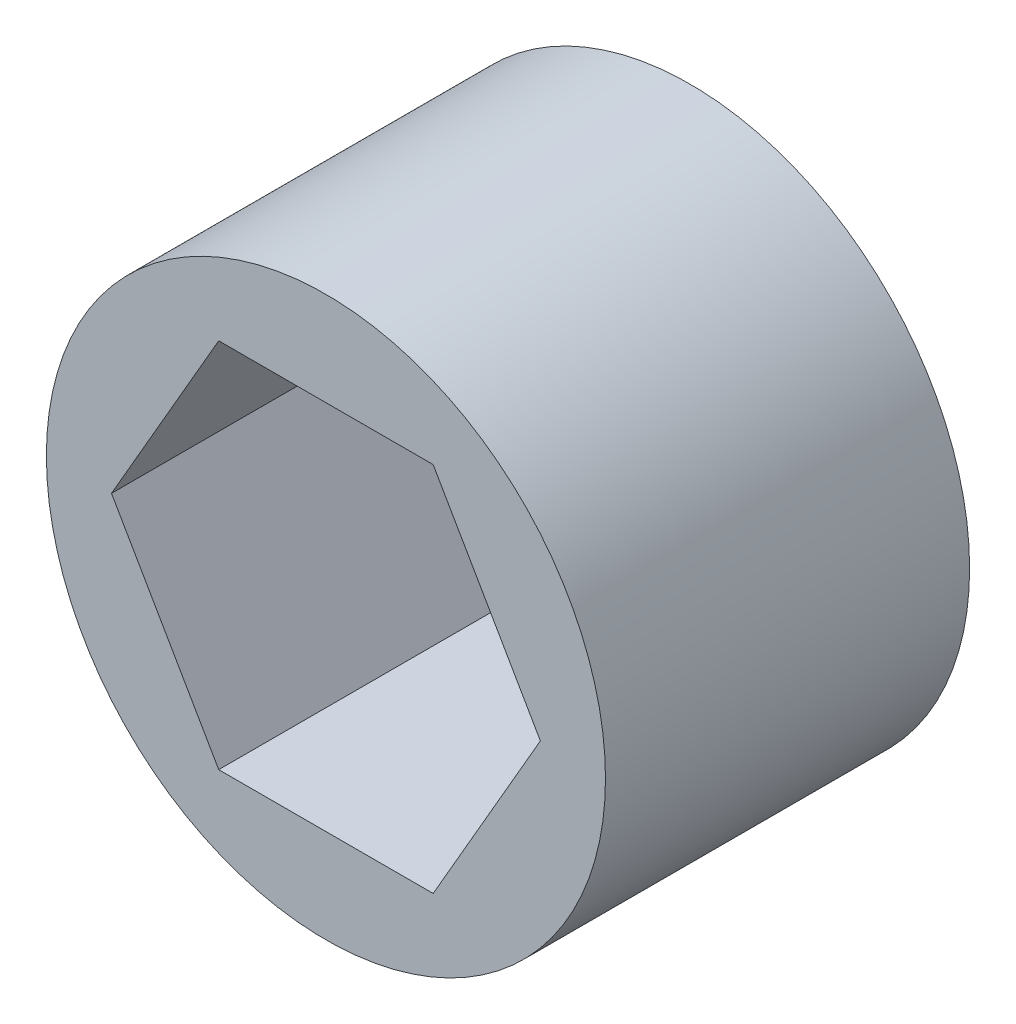
ISO-10303-21;
HEADER;
FILE_DESCRIPTION(('STEP AP214'),'2;1');
FILE_NAME('part.step','',(''),(''),'','','');
FILE_SCHEMA(('AUTOMOTIVE_DESIGN { 1 0 10303 214 1 1 1 1 }'));
ENDSEC;
DATA;
#1=APPLICATION_CONTEXT('core data for automotive mechanical design processes');
#2=APPLICATION_PROTOCOL_DEFINITION('international standard','automotive_design',2000,#1);
#3=PRODUCT_CONTEXT('',#1,'mechanical');
#4=PRODUCT('Part','Part','',(#3));
#5=PRODUCT_RELATED_PRODUCT_CATEGORY('part','',(#4));
#6=PRODUCT_DEFINITION_FORMATION('','',#4);
#7=PRODUCT_DEFINITION_CONTEXT('part definition',#1,'design');
#8=PRODUCT_DEFINITION('design','',#6,#7);
#9=PRODUCT_DEFINITION_SHAPE('','',#8);
#10=(LENGTH_UNIT() NAMED_UNIT(*) SI_UNIT(.MILLI.,.METRE.));
#11=(NAMED_UNIT(*) PLANE_ANGLE_UNIT() SI_UNIT($,.RADIAN.));
#12=(NAMED_UNIT(*) SI_UNIT($,.STERADIAN.) SOLID_ANGLE_UNIT());
#13=UNCERTAINTY_MEASURE_WITH_UNIT(LENGTH_MEASURE(1.E-05),#10,'distance_accuracy_value','');
#14=(GEOMETRIC_REPRESENTATION_CONTEXT(3) GLOBAL_UNCERTAINTY_ASSIGNED_CONTEXT((#13)) GLOBAL_UNIT_ASSIGNED_CONTEXT((#10,
#11,#12)) REPRESENTATION_CONTEXT('',''));
#15=CARTESIAN_POINT('',(0.,0.,0.));
#16=DIRECTION('',(0.,0.,1.));
#17=DIRECTION('',(1.,0.,0.));
#18=AXIS2_PLACEMENT_3D('',#15,#16,#17);
#19=CARTESIAN_POINT('',(-7.47899538708241,0.,6.35));
#20=DIRECTION('',(0.866025403784439,0.5,0.));
#21=DIRECTION('',(-0.5,0.866025403784439,0.));
#22=AXIS2_PLACEMENT_3D('',#19,#20,#21);
#23=PLANE('',#22);
#24=DIRECTION('',(-0.5,0.866025403784438,0.));
#25=VECTOR('',#24,1.);
#26=CARTESIAN_POINT('',(-3.73949769354121,-6.477,6.35));
#27=LINE('',#26,#25);
#28=CARTESIAN_POINT('',(-3.73949769354121,-6.477,6.35));
#29=VERTEX_POINT('',#28);
#30=CARTESIAN_POINT('',(-7.47899538708241,0.,6.35));
#31=VERTEX_POINT('',#30);
#32=EDGE_CURVE('E83',#29,#31,#27,.T.);
#33=ORIENTED_EDGE('',*,*,#32,.F.);
#34=DIRECTION('',(0.,0.,1.));
#35=VECTOR('',#34,1.);
#36=CARTESIAN_POINT('',(-3.73949769354121,-6.477,6.35));
#37=LINE('',#36,#35);
#38=CARTESIAN_POINT('',(-3.73949769354121,-6.477,-6.35));
#39=VERTEX_POINT('',#38);
#40=EDGE_CURVE('E75',#39,#29,#37,.T.);
#41=ORIENTED_EDGE('',*,*,#40,.F.);
#42=DIRECTION('',(-0.5,0.866025403784439,0.));
#43=VECTOR('',#42,1.);
#44=CARTESIAN_POINT('',(-3.73949769354121,-6.477,-6.35));
#45=LINE('',#44,#43);
#46=CARTESIAN_POINT('',(-7.47899538708241,0.,-6.35));
#47=VERTEX_POINT('',#46);
#48=EDGE_CURVE('E115',#39,#47,#45,.T.);
#49=ORIENTED_EDGE('',*,*,#48,.T.);
#50=DIRECTION('',(0.,0.,1.));
#51=VECTOR('',#50,1.);
#52=CARTESIAN_POINT('',(-7.47899538708241,0.,6.35));
#53=LINE('',#52,#51);
#54=EDGE_CURVE('E100',#31,#47,#53,.F.);
#55=ORIENTED_EDGE('',*,*,#54,.F.);
#56=EDGE_LOOP('',(#33,#41,#49,#55));
#57=FACE_BOUND('',#56,.T.);
#58=ADVANCED_FACE('F16',(#57),#23,.T.);
#59=CARTESIAN_POINT('',(-3.73949769354121,6.477,6.35));
#60=DIRECTION('',(0.866025403784439,-0.5,0.));
#61=DIRECTION('',(0.5,0.866025403784439,0.));
#62=AXIS2_PLACEMENT_3D('',#59,#60,#61);
#63=PLANE('',#62);
#64=DIRECTION('',(0.5,0.866025403784439,0.));
#65=VECTOR('',#64,1.);
#66=CARTESIAN_POINT('',(-7.47899538708242,0.,6.35));
#67=LINE('',#66,#65);
#68=CARTESIAN_POINT('',(-3.73949769354121,6.477,6.35));
#69=VERTEX_POINT('',#68);
#70=EDGE_CURVE('E108',#31,#69,#67,.T.);
#71=ORIENTED_EDGE('',*,*,#70,.F.);
#72=ORIENTED_EDGE('',*,*,#54,.T.);
#73=DIRECTION('',(0.5,0.866025403784439,0.));
#74=VECTOR('',#73,1.);
#75=CARTESIAN_POINT('',(-7.47899538708241,0.,-6.35));
#76=LINE('',#75,#74);
#77=CARTESIAN_POINT('',(-3.73949769354121,6.477,-6.35));
#78=VERTEX_POINT('',#77);
#79=EDGE_CURVE('E106',#47,#78,#76,.T.);
#80=ORIENTED_EDGE('',*,*,#79,.T.);
#81=DIRECTION('',(0.,0.,1.));
#82=VECTOR('',#81,1.);
#83=CARTESIAN_POINT('',(-3.73949769354121,6.477,6.35));
#84=LINE('',#83,#82);
#85=EDGE_CURVE('E97',#69,#78,#84,.F.);
#86=ORIENTED_EDGE('',*,*,#85,.F.);
#87=EDGE_LOOP('',(#71,#72,#80,#86));
#88=FACE_BOUND('',#87,.T.);
#89=ADVANCED_FACE('F105',(#88),#63,.T.);
#90=CARTESIAN_POINT('',(3.7394976935412,6.477,6.35));
#91=DIRECTION('',(0.,-1.,0.));
#92=DIRECTION('',(1.,0.,0.));
#93=AXIS2_PLACEMENT_3D('',#90,#91,#92);
#94=PLANE('',#93);
#95=DIRECTION('',(1.,0.,0.));
#96=VECTOR('',#95,1.);
#97=CARTESIAN_POINT('',(0.,6.477,6.35));
#98=LINE('',#97,#96);
#99=CARTESIAN_POINT('',(3.7394976935412,6.477,6.35));
#100=VERTEX_POINT('',#99);
#101=EDGE_CURVE('E125',#69,#100,#98,.T.);
#102=ORIENTED_EDGE('',*,*,#101,.F.);
#103=ORIENTED_EDGE('',*,*,#85,.T.);
#104=DIRECTION('',(1.,0.,0.));
#105=VECTOR('',#104,1.);
#106=CARTESIAN_POINT('',(0.,6.477,-6.35));
#107=LINE('',#106,#105);
#108=CARTESIAN_POINT('',(3.7394976935412,6.477,-6.35));
#109=VERTEX_POINT('',#108);
#110=EDGE_CURVE('E117',#78,#109,#107,.T.);
#111=ORIENTED_EDGE('',*,*,#110,.T.);
#112=DIRECTION('',(0.,0.,1.));
#113=VECTOR('',#112,1.);
#114=CARTESIAN_POINT('',(3.7394976935412,6.47700000000001,6.35));
#115=LINE('',#114,#113);
#116=EDGE_CURVE('E94',#100,#109,#115,.F.);
#117=ORIENTED_EDGE('',*,*,#116,.F.);
#118=EDGE_LOOP('',(#102,#103,#111,#117));
#119=FACE_BOUND('',#118,.T.);
#120=ADVANCED_FACE('F134',(#119),#94,.T.);
#121=CARTESIAN_POINT('',(7.47899538708241,0.,6.35));
#122=DIRECTION('',(-0.866025403784439,-0.5,0.));
#123=DIRECTION('',(0.5,-0.866025403784439,0.));
#124=AXIS2_PLACEMENT_3D('',#121,#122,#123);
#125=PLANE('',#124);
#126=DIRECTION('',(0.5,-0.866025403784438,0.));
#127=VECTOR('',#126,1.);
#128=CARTESIAN_POINT('',(3.7394976935412,6.477,6.35));
#129=LINE('',#128,#127);
#130=CARTESIAN_POINT('',(7.47899538708242,0.,6.35));
#131=VERTEX_POINT('',#130);
#132=EDGE_CURVE('E88',#100,#131,#129,.T.);
#133=ORIENTED_EDGE('',*,*,#132,.F.);
#134=ORIENTED_EDGE('',*,*,#116,.T.);
#135=DIRECTION('',(0.5,-0.866025403784438,0.));
#136=VECTOR('',#135,1.);
#137=CARTESIAN_POINT('',(3.7394976935412,6.477,-6.35));
#138=LINE('',#137,#136);
#139=CARTESIAN_POINT('',(7.47899538708241,0.,-6.35));
#140=VERTEX_POINT('',#139);
#141=EDGE_CURVE('E119',#109,#140,#138,.T.);
#142=ORIENTED_EDGE('',*,*,#141,.T.);
#143=DIRECTION('',(0.,0.,1.));
#144=VECTOR('',#143,1.);
#145=CARTESIAN_POINT('',(7.47899538708242,0.,6.35));
#146=LINE('',#145,#144);
#147=EDGE_CURVE('E64',#131,#140,#146,.F.);
#148=ORIENTED_EDGE('',*,*,#147,.F.);
#149=EDGE_LOOP('',(#133,#134,#142,#148));
#150=FACE_BOUND('',#149,.T.);
#151=ADVANCED_FACE('F131',(#150),#125,.T.);
#152=CARTESIAN_POINT('',(3.73949769354121,-6.477,6.35));
#153=DIRECTION('',(-0.866025403784439,0.5,0.));
#154=DIRECTION('',(-0.5,-0.866025403784439,0.));
#155=AXIS2_PLACEMENT_3D('',#152,#153,#154);
#156=PLANE('',#155);
#157=DIRECTION('',(-0.5,-0.866025403784439,0.));
#158=VECTOR('',#157,1.);
#159=CARTESIAN_POINT('',(7.47899538708241,0.,6.35));
#160=LINE('',#159,#158);
#161=CARTESIAN_POINT('',(3.73949769354121,-6.477,6.35));
#162=VERTEX_POINT('',#161);
#163=EDGE_CURVE('E70',#131,#162,#160,.T.);
#164=ORIENTED_EDGE('',*,*,#163,.F.);
#165=ORIENTED_EDGE('',*,*,#147,.T.);
#166=DIRECTION('',(-0.5,-0.866025403784439,0.));
#167=VECTOR('',#166,1.);
#168=CARTESIAN_POINT('',(7.47899538708241,0.,-6.35));
#169=LINE('',#168,#167);
#170=CARTESIAN_POINT('',(3.73949769354121,-6.477,-6.35));
#171=VERTEX_POINT('',#170);
#172=EDGE_CURVE('E32',#140,#171,#169,.T.);
#173=ORIENTED_EDGE('',*,*,#172,.T.);
#174=DIRECTION('',(0.,0.,1.));
#175=VECTOR('',#174,1.);
#176=CARTESIAN_POINT('',(3.73949769354121,-6.477,6.35));
#177=LINE('',#176,#175);
#178=EDGE_CURVE('E66',#162,#171,#177,.F.);
#179=ORIENTED_EDGE('',*,*,#178,.F.);
#180=EDGE_LOOP('',(#164,#165,#173,#179));
#181=FACE_BOUND('',#180,.T.);
#182=ADVANCED_FACE('F68',(#181),#156,.T.);
#183=CARTESIAN_POINT('',(-3.73949769354121,-6.477,6.35));
#184=DIRECTION('',(0.,1.,0.));
#185=DIRECTION('',(0.,0.,1.));
#186=AXIS2_PLACEMENT_3D('',#183,#184,#185);
#187=PLANE('',#186);
#188=DIRECTION('',(1.,0.,0.));
#189=VECTOR('',#188,1.);
#190=CARTESIAN_POINT('',(0.,-6.477,6.35));
#191=LINE('',#190,#189);
#192=EDGE_CURVE('E78',#162,#29,#191,.F.);
#193=ORIENTED_EDGE('',*,*,#192,.F.);
#194=ORIENTED_EDGE('',*,*,#178,.T.);
#195=DIRECTION('',(1.,0.,0.));
#196=VECTOR('',#195,1.);
#197=CARTESIAN_POINT('',(0.,-6.477,-6.35));
#198=LINE('',#197,#196);
#199=EDGE_CURVE('E127',#171,#39,#198,.F.);
#200=ORIENTED_EDGE('',*,*,#199,.T.);
#201=ORIENTED_EDGE('',*,*,#40,.T.);
#202=EDGE_LOOP('',(#193,#194,#200,#201));
#203=FACE_BOUND('',#202,.T.);
#204=ADVANCED_FACE('F79',(#203),#187,.T.);
#205=CARTESIAN_POINT('',(0.,0.,6.35));
#206=DIRECTION('',(0.,0.,1.));
#207=DIRECTION('',(1.,0.,0.));
#208=AXIS2_PLACEMENT_3D('',#205,#206,#207);
#209=PLANE('',#208);
#210=ORIENTED_EDGE('',*,*,#101,.T.);
#211=ORIENTED_EDGE('',*,*,#132,.T.);
#212=ORIENTED_EDGE('',*,*,#163,.T.);
#213=ORIENTED_EDGE('',*,*,#192,.T.);
#214=ORIENTED_EDGE('',*,*,#32,.T.);
#215=ORIENTED_EDGE('',*,*,#70,.T.);
#216=EDGE_LOOP('',(#210,#211,#212,#213,#214,#215));
#217=FACE_BOUND('',#216,.T.);
#218=CARTESIAN_POINT('',(0.,0.,6.35));
#219=DIRECTION('',(0.,0.,-1.));
#220=DIRECTION('',(-1.,0.,0.));
#221=AXIS2_PLACEMENT_3D('',#218,#219,#220);
#222=CIRCLE('',#221,9.75);
#223=CARTESIAN_POINT('',(-9.75,0.,6.35));
#224=VERTEX_POINT('',#223);
#225=EDGE_CURVE('E19',#224,#224,#222,.T.);
#226=ORIENTED_EDGE('',*,*,#225,.F.);
#227=EDGE_LOOP('',(#226));
#228=FACE_BOUND('',#227,.T.);
#229=ADVANCED_FACE('F86',(#217,#228),#209,.T.);
#230=CARTESIAN_POINT('',(0.,0.,-6.35));
#231=DIRECTION('',(0.,0.,1.));
#232=DIRECTION('',(1.,0.,0.));
#233=AXIS2_PLACEMENT_3D('',#230,#231,#232);
#234=PLANE('',#233);
#235=ORIENTED_EDGE('',*,*,#172,.F.);
#236=ORIENTED_EDGE('',*,*,#141,.F.);
#237=ORIENTED_EDGE('',*,*,#110,.F.);
#238=ORIENTED_EDGE('',*,*,#79,.F.);
#239=ORIENTED_EDGE('',*,*,#48,.F.);
#240=ORIENTED_EDGE('',*,*,#199,.F.);
#241=EDGE_LOOP('',(#235,#236,#237,#238,#239,#240));
#242=FACE_BOUND('',#241,.T.);
#243=CARTESIAN_POINT('',(0.,0.,-6.35));
#244=DIRECTION('',(0.,0.,-1.));
#245=DIRECTION('',(-1.,0.,0.));
#246=AXIS2_PLACEMENT_3D('',#243,#244,#245);
#247=CIRCLE('',#246,9.75);
#248=CARTESIAN_POINT('',(-9.75,0.,-6.35));
#249=VERTEX_POINT('',#248);
#250=EDGE_CURVE('E10',#249,#249,#247,.F.);
#251=ORIENTED_EDGE('',*,*,#250,.F.);
#252=EDGE_LOOP('',(#251));
#253=FACE_BOUND('',#252,.T.);
#254=ADVANCED_FACE('F113',(#242,#253),#234,.F.);
#255=CARTESIAN_POINT('',(0.,0.,6.35));
#256=DIRECTION('',(0.,0.,-1.));
#257=DIRECTION('',(-1.,0.,0.));
#258=AXIS2_PLACEMENT_3D('',#255,#256,#257);
#259=CYLINDRICAL_SURFACE('',#258,9.75);
#260=ORIENTED_EDGE('',*,*,#250,.T.);
#261=EDGE_LOOP('',(#260));
#262=FACE_BOUND('',#261,.T.);
#263=ORIENTED_EDGE('',*,*,#225,.T.);
#264=EDGE_LOOP('',(#263));
#265=FACE_BOUND('',#264,.T.);
#266=ADVANCED_FACE('F143',(#262,#265),#259,.T.);
#267=CLOSED_SHELL('',(#58,#89,#120,#151,#182,#204,#229,#254,#266));
#268=MANIFOLD_SOLID_BREP('B1',#267);
#269=ADVANCED_BREP_SHAPE_REPRESENTATION('',(#18,#268),#14);
#270=SHAPE_DEFINITION_REPRESENTATION(#9,#269);
ENDSEC;
END-ISO-10303-21;
